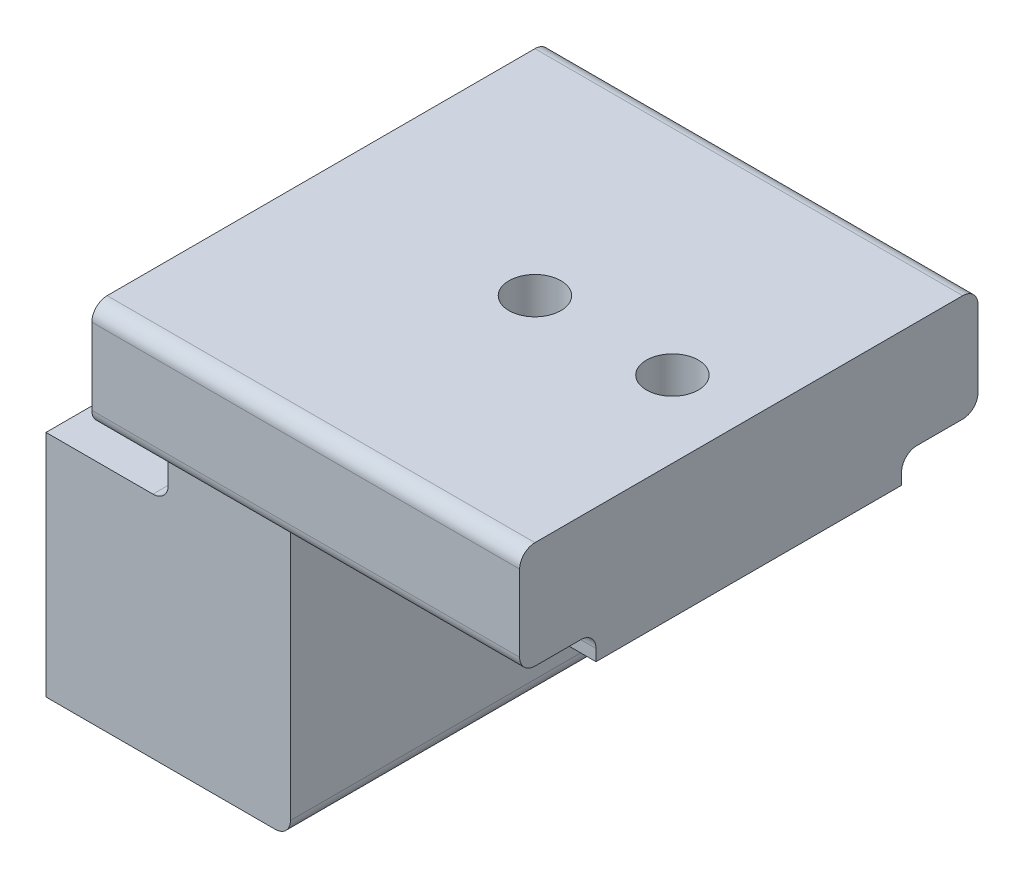
ISO-10303-21;
HEADER;
FILE_DESCRIPTION(('STEP AP214'),'2;1');
FILE_NAME('part.step','',(''),(''),'','','');
FILE_SCHEMA(('AUTOMOTIVE_DESIGN { 1 0 10303 214 1 1 1 1 }'));
ENDSEC;
DATA;
#1=APPLICATION_CONTEXT('core data for automotive mechanical design processes');
#2=APPLICATION_PROTOCOL_DEFINITION('international standard','automotive_design',2000,#1);
#3=PRODUCT_CONTEXT('',#1,'mechanical');
#4=PRODUCT('Part','Part','',(#3));
#5=PRODUCT_RELATED_PRODUCT_CATEGORY('part','',(#4));
#6=PRODUCT_DEFINITION_FORMATION('','',#4);
#7=PRODUCT_DEFINITION_CONTEXT('part definition',#1,'design');
#8=PRODUCT_DEFINITION('design','',#6,#7);
#9=PRODUCT_DEFINITION_SHAPE('','',#8);
#10=(LENGTH_UNIT() NAMED_UNIT(*) SI_UNIT(.MILLI.,.METRE.));
#11=(NAMED_UNIT(*) PLANE_ANGLE_UNIT() SI_UNIT($,.RADIAN.));
#12=(NAMED_UNIT(*) SI_UNIT($,.STERADIAN.) SOLID_ANGLE_UNIT());
#13=UNCERTAINTY_MEASURE_WITH_UNIT(LENGTH_MEASURE(1.E-05),#10,'distance_accuracy_value','');
#14=(GEOMETRIC_REPRESENTATION_CONTEXT(3) GLOBAL_UNCERTAINTY_ASSIGNED_CONTEXT((#13)) GLOBAL_UNIT_ASSIGNED_CONTEXT((#10,
#11,#12)) REPRESENTATION_CONTEXT('',''));
#15=CARTESIAN_POINT('',(0.,0.,0.));
#16=DIRECTION('',(0.,0.,1.));
#17=DIRECTION('',(1.,0.,0.));
#18=AXIS2_PLACEMENT_3D('',#15,#16,#17);
#19=CARTESIAN_POINT('',(0.,0.,0.));
#20=DIRECTION('',(1.,0.,0.));
#21=DIRECTION('',(0.,0.,-1.));
#22=AXIS2_PLACEMENT_3D('',#19,#20,#21);
#23=PLANE('',#22);
#24=DIRECTION('',(0.,-1.,0.));
#25=VECTOR('',#24,1.);
#26=CARTESIAN_POINT('',(0.,0.,-10.));
#27=LINE('',#26,#25);
#28=CARTESIAN_POINT('',(0.,7.5,-10.));
#29=VERTEX_POINT('',#28);
#30=CARTESIAN_POINT('',(0.,-7.5,-10.));
#31=VERTEX_POINT('',#30);
#32=EDGE_CURVE('E42',#29,#31,#27,.T.);
#33=ORIENTED_EDGE('',*,*,#32,.T.);
#34=DIRECTION('',(0.,0.,-1.));
#35=VECTOR('',#34,1.);
#36=CARTESIAN_POINT('',(0.,-7.5,10.));
#37=LINE('',#36,#35);
#38=CARTESIAN_POINT('',(0.,-7.5,10.));
#39=VERTEX_POINT('',#38);
#40=EDGE_CURVE('E273',#39,#31,#37,.T.);
#41=ORIENTED_EDGE('',*,*,#40,.F.);
#42=DIRECTION('',(0.,-1.,0.));
#43=VECTOR('',#42,1.);
#44=CARTESIAN_POINT('',(0.,0.,10.));
#45=LINE('',#44,#43);
#46=CARTESIAN_POINT('',(0.,7.5,10.));
#47=VERTEX_POINT('',#46);
#48=EDGE_CURVE('E363',#47,#39,#45,.T.);
#49=ORIENTED_EDGE('',*,*,#48,.F.);
#50=DIRECTION('',(0.,0.,-1.));
#51=VECTOR('',#50,1.);
#52=CARTESIAN_POINT('',(0.,7.5,10.));
#53=LINE('',#52,#51);
#54=EDGE_CURVE('E11',#47,#29,#53,.T.);
#55=ORIENTED_EDGE('',*,*,#54,.T.);
#56=EDGE_LOOP('',(#33,#41,#49,#55));
#57=FACE_BOUND('',#56,.T.);
#58=CARTESIAN_POINT('',(0.,0.,4.99999999999999));
#59=DIRECTION('',(1.,0.,0.));
#60=DIRECTION('',(0.,0.,-1.));
#61=AXIS2_PLACEMENT_3D('',#58,#59,#60);
#62=CIRCLE('',#61,1.7);
#63=CARTESIAN_POINT('',(0.,0.,3.3));
#64=VERTEX_POINT('',#63);
#65=EDGE_CURVE('E361',#64,#64,#62,.F.);
#66=ORIENTED_EDGE('',*,*,#65,.F.);
#67=EDGE_LOOP('',(#66));
#68=FACE_BOUND('',#67,.T.);
#69=CARTESIAN_POINT('',(0.,0.,-5.));
#70=DIRECTION('',(1.,0.,0.));
#71=DIRECTION('',(0.,0.,-1.));
#72=AXIS2_PLACEMENT_3D('',#69,#70,#71);
#73=CIRCLE('',#72,1.7);
#74=CARTESIAN_POINT('',(0.,0.,-6.7));
#75=VERTEX_POINT('',#74);
#76=EDGE_CURVE('E358',#75,#75,#73,.F.);
#77=ORIENTED_EDGE('',*,*,#76,.F.);
#78=EDGE_LOOP('',(#77));
#79=FACE_BOUND('',#78,.T.);
#80=ADVANCED_FACE('F39',(#57,#68,#79),#23,.F.);
#81=CARTESIAN_POINT('',(12.4785369476531,0.,-5.));
#82=DIRECTION('',(-1.,0.,0.));
#83=DIRECTION('',(0.,0.,1.));
#84=AXIS2_PLACEMENT_3D('',#81,#82,#83);
#85=CONICAL_SURFACE('',#84,1.7,1.02974425867665);
#86=CARTESIAN_POINT('',(13.5,0.,-5.));
#87=VERTEX_POINT('',#86);
#88=VERTEX_LOOP('',#87);
#89=FACE_BOUND('',#88,.T.);
#90=CARTESIAN_POINT('',(12.4785369476531,0.,-5.));
#91=DIRECTION('',(-1.,0.,0.));
#92=DIRECTION('',(0.,0.,1.));
#93=AXIS2_PLACEMENT_3D('',#90,#91,#92);
#94=CIRCLE('',#93,1.7);
#95=CARTESIAN_POINT('',(12.4785369476531,0.,-3.30000000000001));
#96=VERTEX_POINT('',#95);
#97=EDGE_CURVE('E185',#96,#96,#94,.T.);
#98=ORIENTED_EDGE('',*,*,#97,.T.);
#99=EDGE_LOOP('',(#98));
#100=FACE_BOUND('',#99,.T.);
#101=ADVANCED_FACE('F178',(#89,#100),#85,.F.);
#102=CARTESIAN_POINT('',(-6.5,0.,-5.));
#103=DIRECTION('',(-1.,0.,0.));
#104=DIRECTION('',(0.,0.,1.));
#105=AXIS2_PLACEMENT_3D('',#102,#103,#104);
#106=CYLINDRICAL_SURFACE('',#105,1.7);
#107=ORIENTED_EDGE('',*,*,#76,.T.);
#108=EDGE_LOOP('',(#107));
#109=FACE_BOUND('',#108,.T.);
#110=ORIENTED_EDGE('',*,*,#97,.F.);
#111=EDGE_LOOP('',(#110));
#112=FACE_BOUND('',#111,.T.);
#113=ADVANCED_FACE('F181',(#109,#112),#106,.F.);
#114=CARTESIAN_POINT('',(12.4785369476531,0.,4.99999999999999));
#115=DIRECTION('',(-1.,0.,0.));
#116=DIRECTION('',(0.,0.,1.));
#117=AXIS2_PLACEMENT_3D('',#114,#115,#116);
#118=CONICAL_SURFACE('',#117,1.7,1.02974425867665);
#119=CARTESIAN_POINT('',(13.5,0.,4.99999999999999));
#120=VERTEX_POINT('',#119);
#121=VERTEX_LOOP('',#120);
#122=FACE_BOUND('',#121,.T.);
#123=CARTESIAN_POINT('',(12.4785369476531,0.,4.99999999999999));
#124=DIRECTION('',(-1.,0.,0.));
#125=DIRECTION('',(0.,0.,1.));
#126=AXIS2_PLACEMENT_3D('',#123,#124,#125);
#127=CIRCLE('',#126,1.7);
#128=CARTESIAN_POINT('',(12.4785369476531,0.,6.69999999999999));
#129=VERTEX_POINT('',#128);
#130=EDGE_CURVE('E187',#129,#129,#127,.T.);
#131=ORIENTED_EDGE('',*,*,#130,.T.);
#132=EDGE_LOOP('',(#131));
#133=FACE_BOUND('',#132,.T.);
#134=ADVANCED_FACE('F553',(#122,#133),#118,.F.);
#135=CARTESIAN_POINT('',(-6.5,0.,4.99999999999999));
#136=DIRECTION('',(-1.,0.,0.));
#137=DIRECTION('',(0.,0.,1.));
#138=AXIS2_PLACEMENT_3D('',#135,#136,#137);
#139=CYLINDRICAL_SURFACE('',#138,1.7);
#140=ORIENTED_EDGE('',*,*,#65,.T.);
#141=EDGE_LOOP('',(#140));
#142=FACE_BOUND('',#141,.T.);
#143=ORIENTED_EDGE('',*,*,#130,.F.);
#144=EDGE_LOOP('',(#143));
#145=FACE_BOUND('',#144,.T.);
#146=ADVANCED_FACE('F487',(#142,#145),#139,.F.);
#147=CARTESIAN_POINT('',(16.,12.5,10.));
#148=DIRECTION('',(-1.,0.,0.));
#149=DIRECTION('',(0.,-1.,0.));
#150=AXIS2_PLACEMENT_3D('',#147,#148,#149);
#151=PLANE('',#150);
#152=DIRECTION('',(0.,1.,0.));
#153=VECTOR('',#152,1.);
#154=CARTESIAN_POINT('',(16.,12.5,10.));
#155=LINE('',#154,#153);
#156=CARTESIAN_POINT('',(16.,-6.5,10.));
#157=VERTEX_POINT('',#156);
#158=CARTESIAN_POINT('',(16.,12.5,10.));
#159=VERTEX_POINT('',#158);
#160=EDGE_CURVE('E261',#157,#159,#155,.T.);
#161=ORIENTED_EDGE('',*,*,#160,.F.);
#162=DIRECTION('',(0.,0.,-1.));
#163=VECTOR('',#162,1.);
#164=CARTESIAN_POINT('',(16.,-6.5,10.));
#165=LINE('',#164,#163);
#166=CARTESIAN_POINT('',(16.,-6.5,-10.));
#167=VERTEX_POINT('',#166);
#168=EDGE_CURVE('E286',#157,#167,#165,.T.);
#169=ORIENTED_EDGE('',*,*,#168,.T.);
#170=DIRECTION('',(0.,1.,0.));
#171=VECTOR('',#170,1.);
#172=CARTESIAN_POINT('',(16.,12.5,-10.));
#173=LINE('',#172,#171);
#174=CARTESIAN_POINT('',(16.,12.5,-10.));
#175=VERTEX_POINT('',#174);
#176=EDGE_CURVE('E258',#167,#175,#173,.T.);
#177=ORIENTED_EDGE('',*,*,#176,.T.);
#178=DIRECTION('',(0.,0.,-1.));
#179=VECTOR('',#178,1.);
#180=CARTESIAN_POINT('',(16.,12.5,10.));
#181=LINE('',#180,#179);
#182=EDGE_CURVE('E282',#159,#175,#181,.T.);
#183=ORIENTED_EDGE('',*,*,#182,.F.);
#184=EDGE_LOOP('',(#161,#169,#177,#183));
#185=FACE_BOUND('',#184,.T.);
#186=ADVANCED_FACE('F384',(#185),#151,.F.);
#187=CARTESIAN_POINT('',(8.,7.5,10.));
#188=DIRECTION('',(1.,0.,0.));
#189=DIRECTION('',(0.,0.,-1.));
#190=AXIS2_PLACEMENT_3D('',#187,#188,#189);
#191=PLANE('',#190);
#192=DIRECTION('',(0.,-1.,0.));
#193=VECTOR('',#192,1.);
#194=CARTESIAN_POINT('',(8.,7.5,-10.));
#195=LINE('',#194,#193);
#196=CARTESIAN_POINT('',(8.,13.25,-10.));
#197=VERTEX_POINT('',#196);
#198=CARTESIAN_POINT('',(8.,8.5,-10.));
#199=VERTEX_POINT('',#198);
#200=EDGE_CURVE('E275',#197,#199,#195,.T.);
#201=ORIENTED_EDGE('',*,*,#200,.T.);
#202=DIRECTION('',(0.,0.,-1.));
#203=VECTOR('',#202,1.);
#204=CARTESIAN_POINT('',(8.,8.5,10.));
#205=LINE('',#204,#203);
#206=CARTESIAN_POINT('',(8.,8.5,10.));
#207=VERTEX_POINT('',#206);
#208=EDGE_CURVE('E311',#199,#207,#205,.F.);
#209=ORIENTED_EDGE('',*,*,#208,.T.);
#210=DIRECTION('',(0.,-1.,0.));
#211=VECTOR('',#210,1.);
#212=CARTESIAN_POINT('',(8.,7.5,10.));
#213=LINE('',#212,#211);
#214=CARTESIAN_POINT('',(8.,13.25,10.));
#215=VERTEX_POINT('',#214);
#216=EDGE_CURVE('E263',#215,#207,#213,.T.);
#217=ORIENTED_EDGE('',*,*,#216,.F.);
#218=CARTESIAN_POINT('',(8.,13.25,11.));
#219=DIRECTION('',(1.,0.,0.));
#220=DIRECTION('',(0.,0.,-1.));
#221=AXIS2_PLACEMENT_3D('',#218,#219,#220);
#222=CIRCLE('',#221,1.);
#223=CARTESIAN_POINT('',(8.,14.25,11.));
#224=VERTEX_POINT('',#223);
#225=EDGE_CURVE('E354',#215,#224,#222,.T.);
#226=ORIENTED_EDGE('',*,*,#225,.T.);
#227=DIRECTION('',(0.,0.,-1.));
#228=VECTOR('',#227,1.);
#229=CARTESIAN_POINT('',(8.,14.25,10.));
#230=LINE('',#229,#228);
#231=CARTESIAN_POINT('',(8.,14.25,14.));
#232=VERTEX_POINT('',#231);
#233=EDGE_CURVE('E228',#232,#224,#230,.T.);
#234=ORIENTED_EDGE('',*,*,#233,.F.);
#235=CARTESIAN_POINT('',(8.,15.25,14.));
#236=DIRECTION('',(1.,0.,0.));
#237=DIRECTION('',(0.,0.,-1.));
#238=AXIS2_PLACEMENT_3D('',#235,#236,#237);
#239=CIRCLE('',#238,1.);
#240=CARTESIAN_POINT('',(8.,15.25,15.));
#241=VERTEX_POINT('',#240);
#242=EDGE_CURVE('E303',#232,#241,#239,.F.);
#243=ORIENTED_EDGE('',*,*,#242,.T.);
#244=DIRECTION('',(0.,-1.,0.));
#245=VECTOR('',#244,1.);
#246=CARTESIAN_POINT('',(8.,12.5,15.));
#247=LINE('',#246,#245);
#248=CARTESIAN_POINT('',(8.,20.25,15.));
#249=VERTEX_POINT('',#248);
#250=EDGE_CURVE('E225',#249,#241,#247,.T.);
#251=ORIENTED_EDGE('',*,*,#250,.F.);
#252=CARTESIAN_POINT('',(8.,20.25,14.));
#253=DIRECTION('',(1.,0.,0.));
#254=DIRECTION('',(0.,0.,-1.));
#255=AXIS2_PLACEMENT_3D('',#252,#253,#254);
#256=CIRCLE('',#255,1.);
#257=CARTESIAN_POINT('',(8.,21.25,14.));
#258=VERTEX_POINT('',#257);
#259=EDGE_CURVE('E305',#249,#258,#256,.F.);
#260=ORIENTED_EDGE('',*,*,#259,.T.);
#261=DIRECTION('',(0.,0.,1.));
#262=VECTOR('',#261,1.);
#263=CARTESIAN_POINT('',(8.,21.25,10.));
#264=LINE('',#263,#262);
#265=CARTESIAN_POINT('',(8.,21.25,-14.));
#266=VERTEX_POINT('',#265);
#267=EDGE_CURVE('E222',#266,#258,#264,.T.);
#268=ORIENTED_EDGE('',*,*,#267,.F.);
#269=CARTESIAN_POINT('',(8.,20.25,-14.));
#270=DIRECTION('',(1.,0.,0.));
#271=DIRECTION('',(0.,0.,-1.));
#272=AXIS2_PLACEMENT_3D('',#269,#270,#271);
#273=CIRCLE('',#272,1.);
#274=CARTESIAN_POINT('',(8.,20.25,-15.));
#275=VERTEX_POINT('',#274);
#276=EDGE_CURVE('E307',#266,#275,#273,.F.);
#277=ORIENTED_EDGE('',*,*,#276,.T.);
#278=DIRECTION('',(0.,1.,0.));
#279=VECTOR('',#278,1.);
#280=CARTESIAN_POINT('',(8.,12.5,-15.));
#281=LINE('',#280,#279);
#282=CARTESIAN_POINT('',(8.,15.25,-15.));
#283=VERTEX_POINT('',#282);
#284=EDGE_CURVE('E219',#283,#275,#281,.T.);
#285=ORIENTED_EDGE('',*,*,#284,.F.);
#286=CARTESIAN_POINT('',(8.,15.25,-14.));
#287=DIRECTION('',(1.,0.,0.));
#288=DIRECTION('',(0.,0.,-1.));
#289=AXIS2_PLACEMENT_3D('',#286,#287,#288);
#290=CIRCLE('',#289,1.);
#291=CARTESIAN_POINT('',(8.,14.25,-14.));
#292=VERTEX_POINT('',#291);
#293=EDGE_CURVE('E309',#283,#292,#290,.F.);
#294=ORIENTED_EDGE('',*,*,#293,.T.);
#295=DIRECTION('',(0.,0.,-1.));
#296=VECTOR('',#295,1.);
#297=CARTESIAN_POINT('',(8.,14.25,10.));
#298=LINE('',#297,#296);
#299=CARTESIAN_POINT('',(8.,14.25,-11.));
#300=VERTEX_POINT('',#299);
#301=EDGE_CURVE('E216',#300,#292,#298,.T.);
#302=ORIENTED_EDGE('',*,*,#301,.F.);
#303=CARTESIAN_POINT('',(8.,13.25,-11.));
#304=DIRECTION('',(1.,0.,0.));
#305=DIRECTION('',(0.,0.,-1.));
#306=AXIS2_PLACEMENT_3D('',#303,#304,#305);
#307=CIRCLE('',#306,1.);
#308=EDGE_CURVE('E350',#300,#197,#307,.T.);
#309=ORIENTED_EDGE('',*,*,#308,.T.);
#310=EDGE_LOOP('',(#201,#209,#217,#226,#234,#243,#251,#260,#268,#277,#285,#294,#302,#309));
#311=FACE_BOUND('',#310,.T.);
#312=ADVANCED_FACE('F403',(#311),#191,.F.);
#313=CARTESIAN_POINT('',(0.,7.5,10.));
#314=DIRECTION('',(0.,-1.,0.));
#315=DIRECTION('',(0.,0.,-1.));
#316=AXIS2_PLACEMENT_3D('',#313,#314,#315);
#317=PLANE('',#316);
#318=DIRECTION('',(-1.,0.,0.));
#319=VECTOR('',#318,1.);
#320=CARTESIAN_POINT('',(0.,7.5,10.));
#321=LINE('',#320,#319);
#322=CARTESIAN_POINT('',(7.,7.5,10.));
#323=VERTEX_POINT('',#322);
#324=EDGE_CURVE('E267',#323,#47,#321,.T.);
#325=ORIENTED_EDGE('',*,*,#324,.F.);
#326=DIRECTION('',(0.,0.,-1.));
#327=VECTOR('',#326,1.);
#328=CARTESIAN_POINT('',(7.,7.5,-10.));
#329=LINE('',#328,#327);
#330=CARTESIAN_POINT('',(7.,7.5,-10.));
#331=VERTEX_POINT('',#330);
#332=EDGE_CURVE('E300',#323,#331,#329,.T.);
#333=ORIENTED_EDGE('',*,*,#332,.T.);
#334=DIRECTION('',(-1.,0.,0.));
#335=VECTOR('',#334,1.);
#336=CARTESIAN_POINT('',(0.,7.5,-10.));
#337=LINE('',#336,#335);
#338=EDGE_CURVE('E278',#331,#29,#337,.T.);
#339=ORIENTED_EDGE('',*,*,#338,.T.);
#340=ORIENTED_EDGE('',*,*,#54,.F.);
#341=EDGE_LOOP('',(#325,#333,#339,#340));
#342=FACE_BOUND('',#341,.T.);
#343=ADVANCED_FACE('F410',(#342),#317,.F.);
#344=CARTESIAN_POINT('',(16.,-7.5,10.));
#345=DIRECTION('',(0.,1.,0.));
#346=DIRECTION('',(0.,0.,1.));
#347=AXIS2_PLACEMENT_3D('',#344,#345,#346);
#348=PLANE('',#347);
#349=DIRECTION('',(1.,0.,0.));
#350=VECTOR('',#349,1.);
#351=CARTESIAN_POINT('',(16.,-7.5,-10.));
#352=LINE('',#351,#350);
#353=CARTESIAN_POINT('',(15.,-7.5,-10.));
#354=VERTEX_POINT('',#353);
#355=EDGE_CURVE('E264',#31,#354,#352,.T.);
#356=ORIENTED_EDGE('',*,*,#355,.T.);
#357=DIRECTION('',(0.,0.,-1.));
#358=VECTOR('',#357,1.);
#359=CARTESIAN_POINT('',(15.,-7.5,10.));
#360=LINE('',#359,#358);
#361=CARTESIAN_POINT('',(15.,-7.5,10.));
#362=VERTEX_POINT('',#361);
#363=EDGE_CURVE('E293',#354,#362,#360,.F.);
#364=ORIENTED_EDGE('',*,*,#363,.T.);
#365=DIRECTION('',(1.,0.,0.));
#366=VECTOR('',#365,1.);
#367=CARTESIAN_POINT('',(16.,-7.5,10.));
#368=LINE('',#367,#366);
#369=EDGE_CURVE('E270',#39,#362,#368,.T.);
#370=ORIENTED_EDGE('',*,*,#369,.F.);
#371=ORIENTED_EDGE('',*,*,#40,.T.);
#372=EDGE_LOOP('',(#356,#364,#370,#371));
#373=FACE_BOUND('',#372,.T.);
#374=ADVANCED_FACE('F375',(#373),#348,.F.);
#375=CARTESIAN_POINT('',(0.,0.,10.));
#376=DIRECTION('',(0.,0.,-1.));
#377=DIRECTION('',(-1.,0.,0.));
#378=AXIS2_PLACEMENT_3D('',#375,#376,#377);
#379=PLANE('',#378);
#380=ORIENTED_EDGE('',*,*,#324,.T.);
#381=ORIENTED_EDGE('',*,*,#48,.T.);
#382=ORIENTED_EDGE('',*,*,#369,.T.);
#383=CARTESIAN_POINT('',(15.,-6.5,10.));
#384=DIRECTION('',(0.,0.,-1.));
#385=DIRECTION('',(-1.,0.,0.));
#386=AXIS2_PLACEMENT_3D('',#383,#384,#385);
#387=CIRCLE('',#386,1.);
#388=EDGE_CURVE('E298',#362,#157,#387,.F.);
#389=ORIENTED_EDGE('',*,*,#388,.T.);
#390=ORIENTED_EDGE('',*,*,#160,.T.);
#391=DIRECTION('',(-1.,0.,0.));
#392=VECTOR('',#391,1.);
#393=CARTESIAN_POINT('',(36.,12.5,10.));
#394=LINE('',#393,#392);
#395=CARTESIAN_POINT('',(36.,12.5,10.));
#396=VERTEX_POINT('',#395);
#397=EDGE_CURVE('E254',#396,#159,#394,.T.);
#398=ORIENTED_EDGE('',*,*,#397,.F.);
#399=DIRECTION('',(0.,1.,0.));
#400=VECTOR('',#399,1.);
#401=CARTESIAN_POINT('',(36.,12.5,10.));
#402=LINE('',#401,#400);
#403=CARTESIAN_POINT('',(36.,13.25,10.));
#404=VERTEX_POINT('',#403);
#405=EDGE_CURVE('E234',#396,#404,#402,.T.);
#406=ORIENTED_EDGE('',*,*,#405,.T.);
#407=DIRECTION('',(-1.,0.,0.));
#408=VECTOR('',#407,1.);
#409=CARTESIAN_POINT('',(0.,13.25,10.));
#410=LINE('',#409,#408);
#411=EDGE_CURVE('E295',#404,#215,#410,.T.);
#412=ORIENTED_EDGE('',*,*,#411,.T.);
#413=ORIENTED_EDGE('',*,*,#216,.T.);
#414=CARTESIAN_POINT('',(7.,8.5,10.));
#415=DIRECTION('',(0.,0.,-1.));
#416=DIRECTION('',(-1.,0.,0.));
#417=AXIS2_PLACEMENT_3D('',#414,#415,#416);
#418=CIRCLE('',#417,1.);
#419=EDGE_CURVE('E348',#207,#323,#418,.T.);
#420=ORIENTED_EDGE('',*,*,#419,.T.);
#421=EDGE_LOOP('',(#380,#381,#382,#389,#390,#398,#406,#412,#413,#420));
#422=FACE_BOUND('',#421,.T.);
#423=ADVANCED_FACE('F381',(#422),#379,.F.);
#424=CARTESIAN_POINT('',(0.,0.,-10.));
#425=DIRECTION('',(0.,0.,-1.));
#426=DIRECTION('',(-1.,0.,0.));
#427=AXIS2_PLACEMENT_3D('',#424,#425,#426);
#428=PLANE('',#427);
#429=ORIENTED_EDGE('',*,*,#32,.F.);
#430=ORIENTED_EDGE('',*,*,#338,.F.);
#431=CARTESIAN_POINT('',(7.,8.5,-10.));
#432=DIRECTION('',(0.,0.,-1.));
#433=DIRECTION('',(-1.,0.,0.));
#434=AXIS2_PLACEMENT_3D('',#431,#432,#433);
#435=CIRCLE('',#434,1.);
#436=EDGE_CURVE('E346',#331,#199,#435,.F.);
#437=ORIENTED_EDGE('',*,*,#436,.T.);
#438=ORIENTED_EDGE('',*,*,#200,.F.);
#439=DIRECTION('',(-1.,0.,0.));
#440=VECTOR('',#439,1.);
#441=CARTESIAN_POINT('',(36.,13.25,-10.));
#442=LINE('',#441,#440);
#443=CARTESIAN_POINT('',(36.,13.25,-10.));
#444=VERTEX_POINT('',#443);
#445=EDGE_CURVE('E289',#197,#444,#442,.F.);
#446=ORIENTED_EDGE('',*,*,#445,.T.);
#447=DIRECTION('',(0.,-1.,0.));
#448=VECTOR('',#447,1.);
#449=CARTESIAN_POINT('',(36.,12.5,-10.));
#450=LINE('',#449,#448);
#451=CARTESIAN_POINT('',(36.,12.5,-10.));
#452=VERTEX_POINT('',#451);
#453=EDGE_CURVE('E252',#444,#452,#450,.T.);
#454=ORIENTED_EDGE('',*,*,#453,.T.);
#455=DIRECTION('',(-1.,0.,0.));
#456=VECTOR('',#455,1.);
#457=CARTESIAN_POINT('',(36.,12.5,-10.));
#458=LINE('',#457,#456);
#459=EDGE_CURVE('E255',#452,#175,#458,.T.);
#460=ORIENTED_EDGE('',*,*,#459,.T.);
#461=ORIENTED_EDGE('',*,*,#176,.F.);
#462=CARTESIAN_POINT('',(15.,-6.5,-10.));
#463=DIRECTION('',(0.,0.,-1.));
#464=DIRECTION('',(-1.,0.,0.));
#465=AXIS2_PLACEMENT_3D('',#462,#463,#464);
#466=CIRCLE('',#465,1.);
#467=EDGE_CURVE('E291',#167,#354,#466,.T.);
#468=ORIENTED_EDGE('',*,*,#467,.T.);
#469=ORIENTED_EDGE('',*,*,#355,.F.);
#470=EDGE_LOOP('',(#429,#430,#437,#438,#446,#454,#460,#461,#468,#469));
#471=FACE_BOUND('',#470,.T.);
#472=ADVANCED_FACE('F371',(#471),#428,.T.);
#473=CARTESIAN_POINT('',(36.,12.5,10.));
#474=DIRECTION('',(0.,-1.,0.));
#475=DIRECTION('',(1.,0.,0.));
#476=AXIS2_PLACEMENT_3D('',#473,#474,#475);
#477=PLANE('',#476);
#478=CARTESIAN_POINT('',(22.,12.5,0.));
#479=DIRECTION('',(0.,-1.,0.));
#480=DIRECTION('',(0.,0.,-1.));
#481=AXIS2_PLACEMENT_3D('',#478,#479,#480);
#482=CIRCLE('',#481,3.25);
#483=CARTESIAN_POINT('',(22.,12.5,-3.25));
#484=VERTEX_POINT('',#483);
#485=EDGE_CURVE('E190',#484,#484,#482,.T.);
#486=ORIENTED_EDGE('',*,*,#485,.F.);
#487=EDGE_LOOP('',(#486));
#488=FACE_BOUND('',#487,.T.);
#489=CARTESIAN_POINT('',(31.,12.5,0.));
#490=DIRECTION('',(0.,-1.,0.));
#491=DIRECTION('',(0.,0.,-1.));
#492=AXIS2_PLACEMENT_3D('',#489,#490,#491);
#493=CIRCLE('',#492,3.25);
#494=CARTESIAN_POINT('',(31.,12.5,-3.25));
#495=VERTEX_POINT('',#494);
#496=EDGE_CURVE('E204',#495,#495,#493,.T.);
#497=ORIENTED_EDGE('',*,*,#496,.F.);
#498=EDGE_LOOP('',(#497));
#499=FACE_BOUND('',#498,.T.);
#500=ORIENTED_EDGE('',*,*,#182,.T.);
#501=ORIENTED_EDGE('',*,*,#459,.F.);
#502=DIRECTION('',(0.,0.,1.));
#503=VECTOR('',#502,1.);
#504=CARTESIAN_POINT('',(36.,12.5,10.));
#505=LINE('',#504,#503);
#506=EDGE_CURVE('E231',#452,#396,#505,.T.);
#507=ORIENTED_EDGE('',*,*,#506,.T.);
#508=ORIENTED_EDGE('',*,*,#397,.T.);
#509=EDGE_LOOP('',(#500,#501,#507,#508));
#510=FACE_BOUND('',#509,.T.);
#511=ADVANCED_FACE('F387',(#488,#499,#510),#477,.T.);
#512=CARTESIAN_POINT('',(36.,14.25,10.));
#513=DIRECTION('',(0.,-1.,0.));
#514=DIRECTION('',(0.,0.,-1.));
#515=AXIS2_PLACEMENT_3D('',#512,#513,#514);
#516=PLANE('',#515);
#517=DIRECTION('',(0.,0.,1.));
#518=VECTOR('',#517,1.);
#519=CARTESIAN_POINT('',(36.,14.25,10.));
#520=LINE('',#519,#518);
#521=CARTESIAN_POINT('',(36.,14.25,-14.));
#522=VERTEX_POINT('',#521);
#523=CARTESIAN_POINT('',(36.,14.25,-11.));
#524=VERTEX_POINT('',#523);
#525=EDGE_CURVE('E249',#522,#524,#520,.T.);
#526=ORIENTED_EDGE('',*,*,#525,.T.);
#527=DIRECTION('',(-1.,0.,0.));
#528=VECTOR('',#527,1.);
#529=CARTESIAN_POINT('',(8.,14.25,-11.));
#530=LINE('',#529,#528);
#531=EDGE_CURVE('E315',#524,#300,#530,.T.);
#532=ORIENTED_EDGE('',*,*,#531,.T.);
#533=ORIENTED_EDGE('',*,*,#301,.T.);
#534=DIRECTION('',(-1.,0.,0.));
#535=VECTOR('',#534,1.);
#536=CARTESIAN_POINT('',(36.,14.25,-14.));
#537=LINE('',#536,#535);
#538=EDGE_CURVE('E313',#292,#522,#537,.F.);
#539=ORIENTED_EDGE('',*,*,#538,.T.);
#540=EDGE_LOOP('',(#526,#532,#533,#539));
#541=FACE_BOUND('',#540,.T.);
#542=ADVANCED_FACE('F418',(#541),#516,.T.);
#543=CARTESIAN_POINT('',(36.,12.5,-15.));
#544=DIRECTION('',(0.,0.,-1.));
#545=DIRECTION('',(0.,1.,0.));
#546=AXIS2_PLACEMENT_3D('',#543,#544,#545);
#547=PLANE('',#546);
#548=DIRECTION('',(0.,-1.,0.));
#549=VECTOR('',#548,1.);
#550=CARTESIAN_POINT('',(36.,12.5,-15.));
#551=LINE('',#550,#549);
#552=CARTESIAN_POINT('',(36.,20.25,-15.));
#553=VERTEX_POINT('',#552);
#554=CARTESIAN_POINT('',(36.,15.25,-15.));
#555=VERTEX_POINT('',#554);
#556=EDGE_CURVE('E246',#553,#555,#551,.T.);
#557=ORIENTED_EDGE('',*,*,#556,.T.);
#558=DIRECTION('',(-1.,0.,0.));
#559=VECTOR('',#558,1.);
#560=CARTESIAN_POINT('',(36.,15.25,-15.));
#561=LINE('',#560,#559);
#562=EDGE_CURVE('E320',#555,#283,#561,.T.);
#563=ORIENTED_EDGE('',*,*,#562,.T.);
#564=ORIENTED_EDGE('',*,*,#284,.T.);
#565=DIRECTION('',(-1.,0.,0.));
#566=VECTOR('',#565,1.);
#567=CARTESIAN_POINT('',(36.,20.25,-15.));
#568=LINE('',#567,#566);
#569=EDGE_CURVE('E318',#275,#553,#568,.F.);
#570=ORIENTED_EDGE('',*,*,#569,.T.);
#571=EDGE_LOOP('',(#557,#563,#564,#570));
#572=FACE_BOUND('',#571,.T.);
#573=ADVANCED_FACE('F427',(#572),#547,.T.);
#574=CARTESIAN_POINT('',(36.,21.25,10.));
#575=DIRECTION('',(0.,1.,0.));
#576=DIRECTION('',(-1.,0.,0.));
#577=AXIS2_PLACEMENT_3D('',#574,#575,#576);
#578=PLANE('',#577);
#579=CARTESIAN_POINT('',(22.,21.25,0.));
#580=DIRECTION('',(0.,-1.,0.));
#581=DIRECTION('',(0.,0.,-1.));
#582=AXIS2_PLACEMENT_3D('',#579,#580,#581);
#583=CIRCLE('',#582,1.7);
#584=CARTESIAN_POINT('',(22.,21.25,-1.7));
#585=VERTEX_POINT('',#584);
#586=EDGE_CURVE('E201',#585,#585,#583,.T.);
#587=ORIENTED_EDGE('',*,*,#586,.T.);
#588=EDGE_LOOP('',(#587));
#589=FACE_BOUND('',#588,.T.);
#590=CARTESIAN_POINT('',(31.,21.25,0.));
#591=DIRECTION('',(0.,-1.,0.));
#592=DIRECTION('',(0.,0.,-1.));
#593=AXIS2_PLACEMENT_3D('',#590,#591,#592);
#594=CIRCLE('',#593,1.7);
#595=CARTESIAN_POINT('',(31.,21.25,-1.7));
#596=VERTEX_POINT('',#595);
#597=EDGE_CURVE('E213',#596,#596,#594,.T.);
#598=ORIENTED_EDGE('',*,*,#597,.T.);
#599=EDGE_LOOP('',(#598));
#600=FACE_BOUND('',#599,.T.);
#601=DIRECTION('',(0.,0.,-1.));
#602=VECTOR('',#601,1.);
#603=CARTESIAN_POINT('',(36.,21.25,10.));
#604=LINE('',#603,#602);
#605=CARTESIAN_POINT('',(36.,21.25,14.));
#606=VERTEX_POINT('',#605);
#607=CARTESIAN_POINT('',(36.,21.25,-14.));
#608=VERTEX_POINT('',#607);
#609=EDGE_CURVE('E243',#606,#608,#604,.T.);
#610=ORIENTED_EDGE('',*,*,#609,.T.);
#611=DIRECTION('',(-1.,0.,0.));
#612=VECTOR('',#611,1.);
#613=CARTESIAN_POINT('',(36.,21.25,-14.));
#614=LINE('',#613,#612);
#615=EDGE_CURVE('E333',#608,#266,#614,.T.);
#616=ORIENTED_EDGE('',*,*,#615,.T.);
#617=ORIENTED_EDGE('',*,*,#267,.T.);
#618=DIRECTION('',(-1.,0.,0.));
#619=VECTOR('',#618,1.);
#620=CARTESIAN_POINT('',(36.,21.25,14.));
#621=LINE('',#620,#619);
#622=EDGE_CURVE('E331',#258,#606,#621,.F.);
#623=ORIENTED_EDGE('',*,*,#622,.T.);
#624=EDGE_LOOP('',(#610,#616,#617,#623));
#625=FACE_BOUND('',#624,.T.);
#626=ADVANCED_FACE('F436',(#589,#600,#625),#578,.T.);
#627=CARTESIAN_POINT('',(36.,12.5,15.));
#628=DIRECTION('',(0.,0.,1.));
#629=DIRECTION('',(0.,-1.,0.));
#630=AXIS2_PLACEMENT_3D('',#627,#628,#629);
#631=PLANE('',#630);
#632=DIRECTION('',(0.,1.,0.));
#633=VECTOR('',#632,1.);
#634=CARTESIAN_POINT('',(36.,12.5,15.));
#635=LINE('',#634,#633);
#636=CARTESIAN_POINT('',(36.,15.25,15.));
#637=VERTEX_POINT('',#636);
#638=CARTESIAN_POINT('',(36.,20.25,15.));
#639=VERTEX_POINT('',#638);
#640=EDGE_CURVE('E240',#637,#639,#635,.T.);
#641=ORIENTED_EDGE('',*,*,#640,.T.);
#642=DIRECTION('',(-1.,0.,0.));
#643=VECTOR('',#642,1.);
#644=CARTESIAN_POINT('',(36.,20.25,15.));
#645=LINE('',#644,#643);
#646=EDGE_CURVE('E338',#639,#249,#645,.T.);
#647=ORIENTED_EDGE('',*,*,#646,.T.);
#648=ORIENTED_EDGE('',*,*,#250,.T.);
#649=DIRECTION('',(-1.,0.,0.));
#650=VECTOR('',#649,1.);
#651=CARTESIAN_POINT('',(36.,15.25,15.));
#652=LINE('',#651,#650);
#653=EDGE_CURVE('E336',#241,#637,#652,.F.);
#654=ORIENTED_EDGE('',*,*,#653,.T.);
#655=EDGE_LOOP('',(#641,#647,#648,#654));
#656=FACE_BOUND('',#655,.T.);
#657=ADVANCED_FACE('F445',(#656),#631,.T.);
#658=CARTESIAN_POINT('',(36.,14.25,10.));
#659=DIRECTION('',(0.,-1.,0.));
#660=DIRECTION('',(0.,0.,-1.));
#661=AXIS2_PLACEMENT_3D('',#658,#659,#660);
#662=PLANE('',#661);
#663=DIRECTION('',(0.,0.,1.));
#664=VECTOR('',#663,1.);
#665=CARTESIAN_POINT('',(36.,14.25,10.));
#666=LINE('',#665,#664);
#667=CARTESIAN_POINT('',(36.,14.25,11.));
#668=VERTEX_POINT('',#667);
#669=CARTESIAN_POINT('',(36.,14.25,14.));
#670=VERTEX_POINT('',#669);
#671=EDGE_CURVE('E237',#668,#670,#666,.T.);
#672=ORIENTED_EDGE('',*,*,#671,.T.);
#673=DIRECTION('',(-1.,0.,0.));
#674=VECTOR('',#673,1.);
#675=CARTESIAN_POINT('',(36.,14.25,14.));
#676=LINE('',#675,#674);
#677=EDGE_CURVE('E343',#670,#232,#676,.T.);
#678=ORIENTED_EDGE('',*,*,#677,.T.);
#679=ORIENTED_EDGE('',*,*,#233,.T.);
#680=DIRECTION('',(-1.,0.,0.));
#681=VECTOR('',#680,1.);
#682=CARTESIAN_POINT('',(36.,14.25,11.));
#683=LINE('',#682,#681);
#684=EDGE_CURVE('E341',#224,#668,#683,.F.);
#685=ORIENTED_EDGE('',*,*,#684,.T.);
#686=EDGE_LOOP('',(#672,#678,#679,#685));
#687=FACE_BOUND('',#686,.T.);
#688=ADVANCED_FACE('F452',(#687),#662,.T.);
#689=CARTESIAN_POINT('',(36.,0.,0.));
#690=DIRECTION('',(-1.,0.,0.));
#691=DIRECTION('',(0.,-1.,0.));
#692=AXIS2_PLACEMENT_3D('',#689,#690,#691);
#693=PLANE('',#692);
#694=ORIENTED_EDGE('',*,*,#525,.F.);
#695=CARTESIAN_POINT('',(36.,15.25,-14.));
#696=DIRECTION('',(-1.,0.,0.));
#697=DIRECTION('',(0.,-1.,0.));
#698=AXIS2_PLACEMENT_3D('',#695,#696,#697);
#699=CIRCLE('',#698,1.);
#700=EDGE_CURVE('E329',#522,#555,#699,.F.);
#701=ORIENTED_EDGE('',*,*,#700,.T.);
#702=ORIENTED_EDGE('',*,*,#556,.F.);
#703=CARTESIAN_POINT('',(36.,20.25,-14.));
#704=DIRECTION('',(-1.,0.,0.));
#705=DIRECTION('',(0.,-1.,0.));
#706=AXIS2_PLACEMENT_3D('',#703,#704,#705);
#707=CIRCLE('',#706,1.);
#708=EDGE_CURVE('E327',#553,#608,#707,.F.);
#709=ORIENTED_EDGE('',*,*,#708,.T.);
#710=ORIENTED_EDGE('',*,*,#609,.F.);
#711=CARTESIAN_POINT('',(36.,20.25,14.));
#712=DIRECTION('',(-1.,0.,0.));
#713=DIRECTION('',(0.,-1.,0.));
#714=AXIS2_PLACEMENT_3D('',#711,#712,#713);
#715=CIRCLE('',#714,1.);
#716=EDGE_CURVE('E325',#606,#639,#715,.F.);
#717=ORIENTED_EDGE('',*,*,#716,.T.);
#718=ORIENTED_EDGE('',*,*,#640,.F.);
#719=CARTESIAN_POINT('',(36.,15.25,14.));
#720=DIRECTION('',(-1.,0.,0.));
#721=DIRECTION('',(0.,-1.,0.));
#722=AXIS2_PLACEMENT_3D('',#719,#720,#721);
#723=CIRCLE('',#722,1.);
#724=EDGE_CURVE('E323',#637,#670,#723,.F.);
#725=ORIENTED_EDGE('',*,*,#724,.T.);
#726=ORIENTED_EDGE('',*,*,#671,.F.);
#727=CARTESIAN_POINT('',(36.,13.25,11.));
#728=DIRECTION('',(-1.,0.,0.));
#729=DIRECTION('',(0.,-1.,0.));
#730=AXIS2_PLACEMENT_3D('',#727,#728,#729);
#731=CIRCLE('',#730,1.);
#732=EDGE_CURVE('E356',#668,#404,#731,.T.);
#733=ORIENTED_EDGE('',*,*,#732,.T.);
#734=ORIENTED_EDGE('',*,*,#405,.F.);
#735=ORIENTED_EDGE('',*,*,#506,.F.);
#736=ORIENTED_EDGE('',*,*,#453,.F.);
#737=CARTESIAN_POINT('',(36.,13.25,-11.));
#738=DIRECTION('',(-1.,0.,0.));
#739=DIRECTION('',(0.,-1.,0.));
#740=AXIS2_PLACEMENT_3D('',#737,#738,#739);
#741=CIRCLE('',#740,1.);
#742=EDGE_CURVE('E352',#444,#524,#741,.T.);
#743=ORIENTED_EDGE('',*,*,#742,.T.);
#744=EDGE_LOOP('',(#694,#701,#702,#709,#710,#717,#718,#725,#726,#733,#734,#735,#736,#743));
#745=FACE_BOUND('',#744,.T.);
#746=ADVANCED_FACE('F393',(#745),#693,.F.);
#747=CARTESIAN_POINT('',(31.,12.5,0.));
#748=DIRECTION('',(0.,-1.,0.));
#749=DIRECTION('',(0.,0.,-1.));
#750=AXIS2_PLACEMENT_3D('',#747,#748,#749);
#751=CYLINDRICAL_SURFACE('',#750,1.7);
#752=ORIENTED_EDGE('',*,*,#597,.F.);
#753=EDGE_LOOP('',(#752));
#754=FACE_BOUND('',#753,.T.);
#755=CARTESIAN_POINT('',(31.,15.5,0.));
#756=DIRECTION('',(0.,-1.,0.));
#757=DIRECTION('',(0.,0.,-1.));
#758=AXIS2_PLACEMENT_3D('',#755,#756,#757);
#759=CIRCLE('',#758,1.7);
#760=CARTESIAN_POINT('',(31.,15.5,-1.7));
#761=VERTEX_POINT('',#760);
#762=EDGE_CURVE('E210',#761,#761,#759,.T.);
#763=ORIENTED_EDGE('',*,*,#762,.T.);
#764=EDGE_LOOP('',(#763));
#765=FACE_BOUND('',#764,.T.);
#766=ADVANCED_FACE('F459',(#754,#765),#751,.F.);
#767=CARTESIAN_POINT('',(32.7,15.5,0.));
#768=DIRECTION('',(0.,1.,0.));
#769=DIRECTION('',(0.,0.,1.));
#770=AXIS2_PLACEMENT_3D('',#767,#768,#769);
#771=PLANE('',#770);
#772=ORIENTED_EDGE('',*,*,#762,.F.);
#773=EDGE_LOOP('',(#772));
#774=FACE_BOUND('',#773,.T.);
#775=CARTESIAN_POINT('',(31.,15.5,0.));
#776=DIRECTION('',(0.,-1.,0.));
#777=DIRECTION('',(0.,0.,-1.));
#778=AXIS2_PLACEMENT_3D('',#775,#776,#777);
#779=CIRCLE('',#778,3.25);
#780=CARTESIAN_POINT('',(31.,15.5,-3.25));
#781=VERTEX_POINT('',#780);
#782=EDGE_CURVE('E207',#781,#781,#779,.T.);
#783=ORIENTED_EDGE('',*,*,#782,.T.);
#784=EDGE_LOOP('',(#783));
#785=FACE_BOUND('',#784,.T.);
#786=ADVANCED_FACE('F510',(#774,#785),#771,.F.);
#787=CARTESIAN_POINT('',(31.,12.5,0.));
#788=DIRECTION('',(0.,-1.,0.));
#789=DIRECTION('',(0.,0.,-1.));
#790=AXIS2_PLACEMENT_3D('',#787,#788,#789);
#791=CYLINDRICAL_SURFACE('',#790,3.25);
#792=ORIENTED_EDGE('',*,*,#782,.F.);
#793=EDGE_LOOP('',(#792));
#794=FACE_BOUND('',#793,.T.);
#795=ORIENTED_EDGE('',*,*,#496,.T.);
#796=EDGE_LOOP('',(#795));
#797=FACE_BOUND('',#796,.T.);
#798=ADVANCED_FACE('F507',(#794,#797),#791,.F.);
#799=CARTESIAN_POINT('',(22.,12.5,0.));
#800=DIRECTION('',(0.,-1.,0.));
#801=DIRECTION('',(0.,0.,-1.));
#802=AXIS2_PLACEMENT_3D('',#799,#800,#801);
#803=CYLINDRICAL_SURFACE('',#802,1.7);
#804=ORIENTED_EDGE('',*,*,#586,.F.);
#805=EDGE_LOOP('',(#804));
#806=FACE_BOUND('',#805,.T.);
#807=CARTESIAN_POINT('',(22.,15.5,0.));
#808=DIRECTION('',(0.,-1.,0.));
#809=DIRECTION('',(0.,0.,-1.));
#810=AXIS2_PLACEMENT_3D('',#807,#808,#809);
#811=CIRCLE('',#810,1.7);
#812=CARTESIAN_POINT('',(22.,15.5,-1.7));
#813=VERTEX_POINT('',#812);
#814=EDGE_CURVE('E198',#813,#813,#811,.T.);
#815=ORIENTED_EDGE('',*,*,#814,.T.);
#816=EDGE_LOOP('',(#815));
#817=FACE_BOUND('',#816,.T.);
#818=ADVANCED_FACE('F509',(#806,#817),#803,.F.);
#819=CARTESIAN_POINT('',(23.7,15.5,0.));
#820=DIRECTION('',(0.,1.,0.));
#821=DIRECTION('',(0.,0.,1.));
#822=AXIS2_PLACEMENT_3D('',#819,#820,#821);
#823=PLANE('',#822);
#824=ORIENTED_EDGE('',*,*,#814,.F.);
#825=EDGE_LOOP('',(#824));
#826=FACE_BOUND('',#825,.T.);
#827=CARTESIAN_POINT('',(22.,15.5,0.));
#828=DIRECTION('',(0.,-1.,0.));
#829=DIRECTION('',(0.,0.,-1.));
#830=AXIS2_PLACEMENT_3D('',#827,#828,#829);
#831=CIRCLE('',#830,3.25);
#832=CARTESIAN_POINT('',(22.,15.5,-3.25));
#833=VERTEX_POINT('',#832);
#834=EDGE_CURVE('E195',#833,#833,#831,.T.);
#835=ORIENTED_EDGE('',*,*,#834,.T.);
#836=EDGE_LOOP('',(#835));
#837=FACE_BOUND('',#836,.T.);
#838=ADVANCED_FACE('F517',(#826,#837),#823,.F.);
#839=CARTESIAN_POINT('',(22.,12.5,0.));
#840=DIRECTION('',(0.,-1.,0.));
#841=DIRECTION('',(0.,0.,-1.));
#842=AXIS2_PLACEMENT_3D('',#839,#840,#841);
#843=CYLINDRICAL_SURFACE('',#842,3.25);
#844=ORIENTED_EDGE('',*,*,#834,.F.);
#845=EDGE_LOOP('',(#844));
#846=FACE_BOUND('',#845,.T.);
#847=ORIENTED_EDGE('',*,*,#485,.T.);
#848=EDGE_LOOP('',(#847));
#849=FACE_BOUND('',#848,.T.);
#850=ADVANCED_FACE('F484',(#846,#849),#843,.F.);
#851=CARTESIAN_POINT('',(15.,-6.5,10.));
#852=DIRECTION('',(0.,0.,-1.));
#853=DIRECTION('',(-1.,0.,0.));
#854=AXIS2_PLACEMENT_3D('',#851,#852,#853);
#855=CYLINDRICAL_SURFACE('',#854,1.);
#856=ORIENTED_EDGE('',*,*,#388,.F.);
#857=ORIENTED_EDGE('',*,*,#363,.F.);
#858=ORIENTED_EDGE('',*,*,#467,.F.);
#859=ORIENTED_EDGE('',*,*,#168,.F.);
#860=EDGE_LOOP('',(#856,#857,#858,#859));
#861=FACE_BOUND('',#860,.T.);
#862=ADVANCED_FACE('F378',(#861),#855,.T.);
#863=CARTESIAN_POINT('',(7.,8.5,10.));
#864=DIRECTION('',(0.,0.,1.));
#865=DIRECTION('',(1.,0.,0.));
#866=AXIS2_PLACEMENT_3D('',#863,#864,#865);
#867=CYLINDRICAL_SURFACE('',#866,1.);
#868=ORIENTED_EDGE('',*,*,#419,.F.);
#869=ORIENTED_EDGE('',*,*,#208,.F.);
#870=ORIENTED_EDGE('',*,*,#436,.F.);
#871=ORIENTED_EDGE('',*,*,#332,.F.);
#872=EDGE_LOOP('',(#868,#869,#870,#871));
#873=FACE_BOUND('',#872,.T.);
#874=ADVANCED_FACE('F408',(#873),#867,.F.);
#875=CARTESIAN_POINT('',(36.,13.25,-11.));
#876=DIRECTION('',(1.,0.,0.));
#877=DIRECTION('',(0.,1.,0.));
#878=AXIS2_PLACEMENT_3D('',#875,#876,#877);
#879=CYLINDRICAL_SURFACE('',#878,1.);
#880=ORIENTED_EDGE('',*,*,#742,.F.);
#881=ORIENTED_EDGE('',*,*,#445,.F.);
#882=ORIENTED_EDGE('',*,*,#308,.F.);
#883=ORIENTED_EDGE('',*,*,#531,.F.);
#884=EDGE_LOOP('',(#880,#881,#882,#883));
#885=FACE_BOUND('',#884,.T.);
#886=ADVANCED_FACE('F414',(#885),#879,.F.);
#887=CARTESIAN_POINT('',(36.,15.25,-14.));
#888=DIRECTION('',(-1.,0.,0.));
#889=DIRECTION('',(0.,-1.,0.));
#890=AXIS2_PLACEMENT_3D('',#887,#888,#889);
#891=CYLINDRICAL_SURFACE('',#890,1.);
#892=ORIENTED_EDGE('',*,*,#700,.F.);
#893=ORIENTED_EDGE('',*,*,#538,.F.);
#894=ORIENTED_EDGE('',*,*,#293,.F.);
#895=ORIENTED_EDGE('',*,*,#562,.F.);
#896=EDGE_LOOP('',(#892,#893,#894,#895));
#897=FACE_BOUND('',#896,.T.);
#898=ADVANCED_FACE('F422',(#897),#891,.T.);
#899=CARTESIAN_POINT('',(36.,20.25,-14.));
#900=DIRECTION('',(-1.,0.,0.));
#901=DIRECTION('',(0.,-1.,0.));
#902=AXIS2_PLACEMENT_3D('',#899,#900,#901);
#903=CYLINDRICAL_SURFACE('',#902,1.);
#904=ORIENTED_EDGE('',*,*,#708,.F.);
#905=ORIENTED_EDGE('',*,*,#569,.F.);
#906=ORIENTED_EDGE('',*,*,#276,.F.);
#907=ORIENTED_EDGE('',*,*,#615,.F.);
#908=EDGE_LOOP('',(#904,#905,#906,#907));
#909=FACE_BOUND('',#908,.T.);
#910=ADVANCED_FACE('F431',(#909),#903,.T.);
#911=CARTESIAN_POINT('',(36.,20.25,14.));
#912=DIRECTION('',(-1.,0.,0.));
#913=DIRECTION('',(0.,-1.,0.));
#914=AXIS2_PLACEMENT_3D('',#911,#912,#913);
#915=CYLINDRICAL_SURFACE('',#914,1.);
#916=ORIENTED_EDGE('',*,*,#716,.F.);
#917=ORIENTED_EDGE('',*,*,#622,.F.);
#918=ORIENTED_EDGE('',*,*,#259,.F.);
#919=ORIENTED_EDGE('',*,*,#646,.F.);
#920=EDGE_LOOP('',(#916,#917,#918,#919));
#921=FACE_BOUND('',#920,.T.);
#922=ADVANCED_FACE('F440',(#921),#915,.T.);
#923=CARTESIAN_POINT('',(36.,15.25,14.));
#924=DIRECTION('',(-1.,0.,0.));
#925=DIRECTION('',(0.,-1.,0.));
#926=AXIS2_PLACEMENT_3D('',#923,#924,#925);
#927=CYLINDRICAL_SURFACE('',#926,1.);
#928=ORIENTED_EDGE('',*,*,#724,.F.);
#929=ORIENTED_EDGE('',*,*,#653,.F.);
#930=ORIENTED_EDGE('',*,*,#242,.F.);
#931=ORIENTED_EDGE('',*,*,#677,.F.);
#932=EDGE_LOOP('',(#928,#929,#930,#931));
#933=FACE_BOUND('',#932,.T.);
#934=ADVANCED_FACE('F449',(#933),#927,.T.);
#935=CARTESIAN_POINT('',(0.,13.25,11.));
#936=DIRECTION('',(-1.,0.,0.));
#937=DIRECTION('',(0.,-1.,0.));
#938=AXIS2_PLACEMENT_3D('',#935,#936,#937);
#939=CYLINDRICAL_SURFACE('',#938,1.);
#940=ORIENTED_EDGE('',*,*,#732,.F.);
#941=ORIENTED_EDGE('',*,*,#684,.F.);
#942=ORIENTED_EDGE('',*,*,#225,.F.);
#943=ORIENTED_EDGE('',*,*,#411,.F.);
#944=EDGE_LOOP('',(#940,#941,#942,#943));
#945=FACE_BOUND('',#944,.T.);
#946=ADVANCED_FACE('F399',(#945),#939,.F.);
#947=CLOSED_SHELL('',(#80,#101,#113,#134,#146,#186,#312,#343,#374,#423,#472,#511,#542,#573,#626,
#657,#688,#746,#766,#786,#798,#818,#838,#850,#862,#874,#886,#898,#910,#922,#934,#946));
#948=MANIFOLD_SOLID_BREP('B2',#947);
#949=ADVANCED_BREP_SHAPE_REPRESENTATION('',(#18,#948),#14);
#950=SHAPE_DEFINITION_REPRESENTATION(#9,#949);
ENDSEC;
END-ISO-10303-21;
